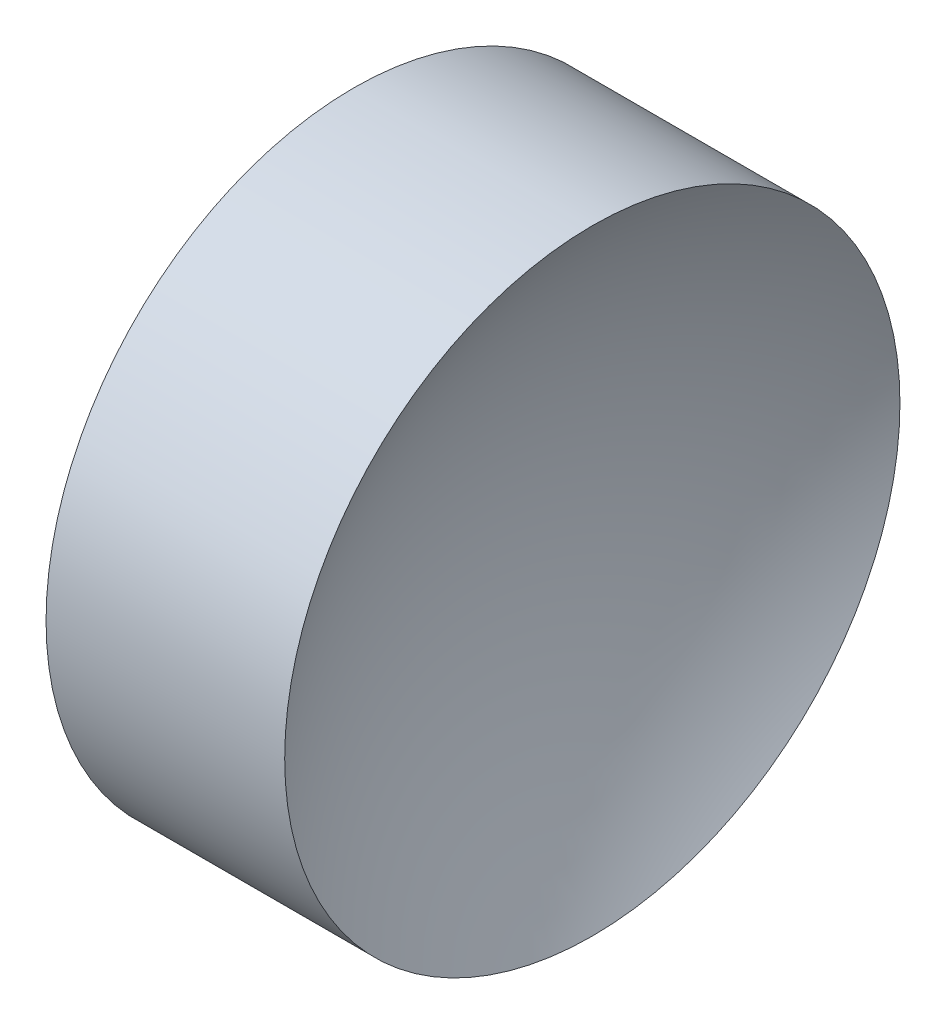
ISO-10303-21;
HEADER;
FILE_DESCRIPTION(('STEP AP214'),'2;1');
FILE_NAME('part.step','',(''),(''),'','','');
FILE_SCHEMA(('AUTOMOTIVE_DESIGN { 1 0 10303 214 1 1 1 1 }'));
ENDSEC;
DATA;
#1=APPLICATION_CONTEXT('core data for automotive mechanical design processes');
#2=APPLICATION_PROTOCOL_DEFINITION('international standard','automotive_design',2000,#1);
#3=PRODUCT_CONTEXT('',#1,'mechanical');
#4=PRODUCT('Part','Part','',(#3));
#5=PRODUCT_RELATED_PRODUCT_CATEGORY('part','',(#4));
#6=PRODUCT_DEFINITION_FORMATION('','',#4);
#7=PRODUCT_DEFINITION_CONTEXT('part definition',#1,'design');
#8=PRODUCT_DEFINITION('design','',#6,#7);
#9=PRODUCT_DEFINITION_SHAPE('','',#8);
#10=(LENGTH_UNIT() NAMED_UNIT(*) SI_UNIT(.MILLI.,.METRE.));
#11=(NAMED_UNIT(*) PLANE_ANGLE_UNIT() SI_UNIT($,.RADIAN.));
#12=(NAMED_UNIT(*) SI_UNIT($,.STERADIAN.) SOLID_ANGLE_UNIT());
#13=UNCERTAINTY_MEASURE_WITH_UNIT(LENGTH_MEASURE(1.E-05),#10,'distance_accuracy_value','');
#14=(GEOMETRIC_REPRESENTATION_CONTEXT(3) GLOBAL_UNCERTAINTY_ASSIGNED_CONTEXT((#13)) GLOBAL_UNIT_ASSIGNED_CONTEXT((#10,
#11,#12)) REPRESENTATION_CONTEXT('',''));
#15=CARTESIAN_POINT('',(0.,0.,0.));
#16=DIRECTION('',(0.,0.,1.));
#17=DIRECTION('',(1.,0.,0.));
#18=AXIS2_PLACEMENT_3D('',#15,#16,#17);
#19=CARTESIAN_POINT('',(29.4308754892866,13.031126091403,0.));
#20=DIRECTION('',(-1.,0.,0.));
#21=DIRECTION('',(0.,-1.,0.));
#22=AXIS2_PLACEMENT_3D('',#19,#20,#21);
#23=SPHERICAL_SURFACE('',#22,5.73);
#24=CARTESIAN_POINT('',(24.6443945272436,13.031126091403,0.));
#25=DIRECTION('',(-1.,0.,0.));
#26=DIRECTION('',(0.,0.,1.));
#27=AXIS2_PLACEMENT_3D('',#24,#25,#26);
#28=CIRCLE('',#27,3.15);
#29=CARTESIAN_POINT('',(24.6443945272436,13.031126091403,3.15));
#30=VERTEX_POINT('',#29);
#31=EDGE_CURVE('E10',#30,#30,#28,.T.);
#32=ORIENTED_EDGE('',*,*,#31,.F.);
#33=EDGE_LOOP('',(#32));
#34=FACE_BOUND('',#33,.T.);
#35=ADVANCED_FACE('F35',(#34),#23,.F.);
#36=CARTESIAN_POINT('',(21.1564719224443,13.031126091403,0.));
#37=DIRECTION('',(-1.,0.,0.));
#38=DIRECTION('',(0.,0.,1.));
#39=AXIS2_PLACEMENT_3D('',#36,#37,#38);
#40=CYLINDRICAL_SURFACE('',#39,3.15);
#41=CARTESIAN_POINT('',(22.2008754892866,13.031126091403,0.));
#42=DIRECTION('',(-1.,0.,0.));
#43=DIRECTION('',(0.,0.,1.));
#44=AXIS2_PLACEMENT_3D('',#41,#42,#43);
#45=CIRCLE('',#44,3.15);
#46=CARTESIAN_POINT('',(22.2008754892866,13.031126091403,3.15));
#47=VERTEX_POINT('',#46);
#48=EDGE_CURVE('E41',#47,#47,#45,.T.);
#49=ORIENTED_EDGE('',*,*,#48,.F.);
#50=EDGE_LOOP('',(#49));
#51=FACE_BOUND('',#50,.T.);
#52=ORIENTED_EDGE('',*,*,#31,.T.);
#53=EDGE_LOOP('',(#52));
#54=FACE_BOUND('',#53,.T.);
#55=ADVANCED_FACE('F49',(#51,#54),#40,.T.);
#56=CARTESIAN_POINT('',(22.2008754892866,13.031126091403,0.));
#57=DIRECTION('',(1.,0.,0.));
#58=DIRECTION('',(0.,0.,-1.));
#59=AXIS2_PLACEMENT_3D('',#56,#57,#58);
#60=PLANE('',#59);
#61=ORIENTED_EDGE('',*,*,#48,.T.);
#62=EDGE_LOOP('',(#61));
#63=FACE_BOUND('',#62,.T.);
#64=ADVANCED_FACE('F47',(#63),#60,.F.);
#65=CLOSED_SHELL('',(#35,#55,#64));
#66=MANIFOLD_SOLID_BREP('B2',#65);
#67=ADVANCED_BREP_SHAPE_REPRESENTATION('',(#18,#66),#14);
#68=SHAPE_DEFINITION_REPRESENTATION(#9,#67);
ENDSEC;
END-ISO-10303-21;
